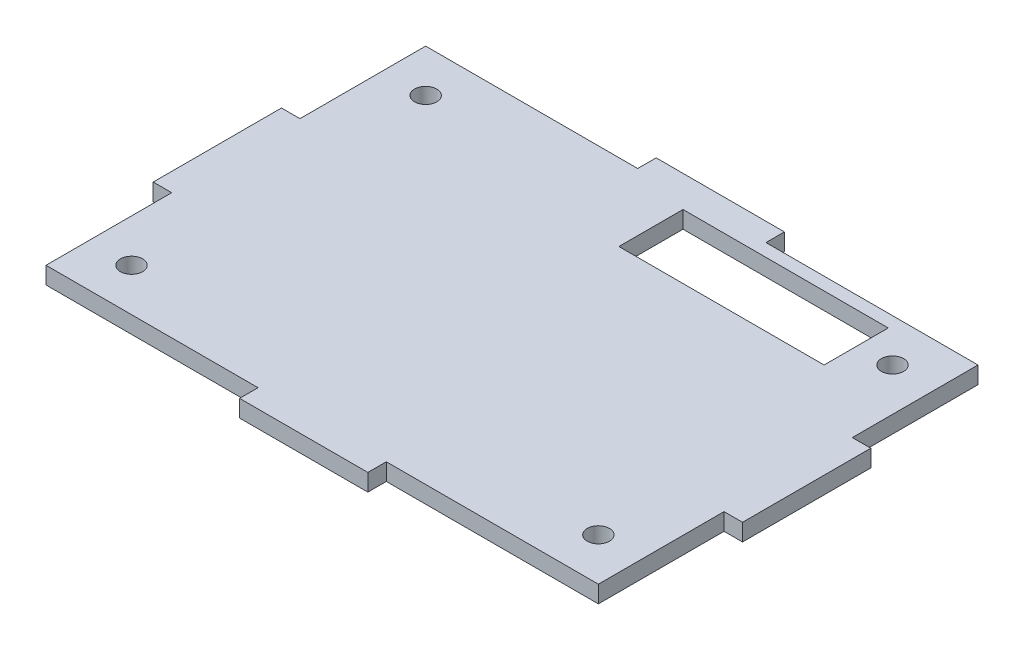
ISO-10303-21;
HEADER;
FILE_DESCRIPTION(('STEP AP214'),'2;1');
FILE_NAME('part.step','',(''),(''),'','','');
FILE_SCHEMA(('AUTOMOTIVE_DESIGN { 1 0 10303 214 1 1 1 1 }'));
ENDSEC;
DATA;
#1=APPLICATION_CONTEXT('core data for automotive mechanical design processes');
#2=APPLICATION_PROTOCOL_DEFINITION('international standard','automotive_design',2000,#1);
#3=PRODUCT_CONTEXT('',#1,'mechanical');
#4=PRODUCT('Part','Part','',(#3));
#5=PRODUCT_RELATED_PRODUCT_CATEGORY('part','',(#4));
#6=PRODUCT_DEFINITION_FORMATION('','',#4);
#7=PRODUCT_DEFINITION_CONTEXT('part definition',#1,'design');
#8=PRODUCT_DEFINITION('design','',#6,#7);
#9=PRODUCT_DEFINITION_SHAPE('','',#8);
#10=(LENGTH_UNIT() NAMED_UNIT(*) SI_UNIT(.MILLI.,.METRE.));
#11=(NAMED_UNIT(*) PLANE_ANGLE_UNIT() SI_UNIT($,.RADIAN.));
#12=(NAMED_UNIT(*) SI_UNIT($,.STERADIAN.) SOLID_ANGLE_UNIT());
#13=UNCERTAINTY_MEASURE_WITH_UNIT(LENGTH_MEASURE(1.E-05),#10,'distance_accuracy_value','');
#14=(GEOMETRIC_REPRESENTATION_CONTEXT(3) GLOBAL_UNCERTAINTY_ASSIGNED_CONTEXT((#13)) GLOBAL_UNIT_ASSIGNED_CONTEXT((#10,
#11,#12)) REPRESENTATION_CONTEXT('',''));
#15=CARTESIAN_POINT('',(0.,0.,0.));
#16=DIRECTION('',(0.,0.,1.));
#17=DIRECTION('',(1.,0.,0.));
#18=AXIS2_PLACEMENT_3D('',#15,#16,#17);
#19=CARTESIAN_POINT('',(-41.021,2.54,28.194));
#20=DIRECTION('',(1.,0.,0.));
#21=DIRECTION('',(0.,0.,-1.));
#22=AXIS2_PLACEMENT_3D('',#19,#20,#21);
#23=PLANE('',#22);
#24=DIRECTION('',(0.,1.,0.));
#25=VECTOR('',#24,1.);
#26=CARTESIAN_POINT('',(-41.021,-19.2464969862051,9.525));
#27=LINE('',#26,#25);
#28=CARTESIAN_POINT('',(-41.021,0.,9.52500000000001));
#29=VERTEX_POINT('',#28);
#30=CARTESIAN_POINT('',(-41.021,2.54,9.525));
#31=VERTEX_POINT('',#30);
#32=EDGE_CURVE('E234',#29,#31,#27,.T.);
#33=ORIENTED_EDGE('',*,*,#32,.F.);
#34=DIRECTION('',(0.,0.,1.));
#35=VECTOR('',#34,1.);
#36=CARTESIAN_POINT('',(-41.021,0.,28.194));
#37=LINE('',#36,#35);
#38=CARTESIAN_POINT('',(-41.021,0.,28.194));
#39=VERTEX_POINT('',#38);
#40=EDGE_CURVE('E352',#29,#39,#37,.T.);
#41=ORIENTED_EDGE('',*,*,#40,.T.);
#42=DIRECTION('',(0.,-1.,0.));
#43=VECTOR('',#42,1.);
#44=CARTESIAN_POINT('',(-41.021,2.54,28.194));
#45=LINE('',#44,#43);
#46=CARTESIAN_POINT('',(-41.021,2.54,28.194));
#47=VERTEX_POINT('',#46);
#48=EDGE_CURVE('E11',#47,#39,#45,.T.);
#49=ORIENTED_EDGE('',*,*,#48,.F.);
#50=DIRECTION('',(0.,0.,1.));
#51=VECTOR('',#50,1.);
#52=CARTESIAN_POINT('',(-41.021,2.54,28.194));
#53=LINE('',#52,#51);
#54=EDGE_CURVE('E359',#31,#47,#53,.T.);
#55=ORIENTED_EDGE('',*,*,#54,.F.);
#56=EDGE_LOOP('',(#33,#41,#49,#55));
#57=FACE_BOUND('',#56,.T.);
#58=ADVANCED_FACE('F33',(#57),#23,.F.);
#59=CARTESIAN_POINT('',(41.021,2.54,28.194));
#60=DIRECTION('',(-1.,0.,0.));
#61=DIRECTION('',(0.,0.,1.));
#62=AXIS2_PLACEMENT_3D('',#59,#60,#61);
#63=PLANE('',#62);
#64=DIRECTION('',(0.,1.,0.));
#65=VECTOR('',#64,1.);
#66=CARTESIAN_POINT('',(41.021,-19.2464969862051,-9.525));
#67=LINE('',#66,#65);
#68=CARTESIAN_POINT('',(41.021,0.,-9.52499999999998));
#69=VERTEX_POINT('',#68);
#70=CARTESIAN_POINT('',(41.021,2.54,-9.525));
#71=VERTEX_POINT('',#70);
#72=EDGE_CURVE('E259',#69,#71,#67,.T.);
#73=ORIENTED_EDGE('',*,*,#72,.F.);
#74=DIRECTION('',(0.,0.,-1.));
#75=VECTOR('',#74,1.);
#76=CARTESIAN_POINT('',(41.021,0.,28.194));
#77=LINE('',#76,#75);
#78=CARTESIAN_POINT('',(41.021,0.,-28.194));
#79=VERTEX_POINT('',#78);
#80=EDGE_CURVE('E377',#69,#79,#77,.T.);
#81=ORIENTED_EDGE('',*,*,#80,.T.);
#82=DIRECTION('',(0.,-1.,0.));
#83=VECTOR('',#82,1.);
#84=CARTESIAN_POINT('',(41.021,2.54,-28.194));
#85=LINE('',#84,#83);
#86=CARTESIAN_POINT('',(41.021,2.54,-28.194));
#87=VERTEX_POINT('',#86);
#88=EDGE_CURVE('E385',#87,#79,#85,.T.);
#89=ORIENTED_EDGE('',*,*,#88,.F.);
#90=DIRECTION('',(0.,0.,-1.));
#91=VECTOR('',#90,1.);
#92=CARTESIAN_POINT('',(41.021,2.54,28.194));
#93=LINE('',#92,#91);
#94=EDGE_CURVE('E363',#71,#87,#93,.T.);
#95=ORIENTED_EDGE('',*,*,#94,.F.);
#96=EDGE_LOOP('',(#73,#81,#89,#95));
#97=FACE_BOUND('',#96,.T.);
#98=ADVANCED_FACE('F473',(#97),#63,.F.);
#99=CARTESIAN_POINT('',(41.021,2.54,28.194));
#100=DIRECTION('',(0.,0.,-1.));
#101=DIRECTION('',(-1.,0.,0.));
#102=AXIS2_PLACEMENT_3D('',#99,#100,#101);
#103=PLANE('',#102);
#104=DIRECTION('',(0.,1.,0.));
#105=VECTOR('',#104,1.);
#106=CARTESIAN_POINT('',(9.52500000000001,-19.2464969862051,28.194));
#107=LINE('',#106,#105);
#108=CARTESIAN_POINT('',(9.52500000000001,0.,28.194));
#109=VERTEX_POINT('',#108);
#110=CARTESIAN_POINT('',(9.52500000000001,2.54,28.194));
#111=VERTEX_POINT('',#110);
#112=EDGE_CURVE('E298',#109,#111,#107,.T.);
#113=ORIENTED_EDGE('',*,*,#112,.F.);
#114=DIRECTION('',(1.,0.,0.));
#115=VECTOR('',#114,1.);
#116=CARTESIAN_POINT('',(41.021,0.,28.194));
#117=LINE('',#116,#115);
#118=CARTESIAN_POINT('',(41.021,0.,28.194));
#119=VERTEX_POINT('',#118);
#120=EDGE_CURVE('E374',#109,#119,#117,.T.);
#121=ORIENTED_EDGE('',*,*,#120,.T.);
#122=DIRECTION('',(0.,-1.,0.));
#123=VECTOR('',#122,1.);
#124=CARTESIAN_POINT('',(41.021,2.54,28.194));
#125=LINE('',#124,#123);
#126=CARTESIAN_POINT('',(41.021,2.54,28.194));
#127=VERTEX_POINT('',#126);
#128=EDGE_CURVE('E41',#127,#119,#125,.T.);
#129=ORIENTED_EDGE('',*,*,#128,.F.);
#130=DIRECTION('',(1.,0.,0.));
#131=VECTOR('',#130,1.);
#132=CARTESIAN_POINT('',(41.021,2.54,28.194));
#133=LINE('',#132,#131);
#134=EDGE_CURVE('E358',#111,#127,#133,.T.);
#135=ORIENTED_EDGE('',*,*,#134,.F.);
#136=EDGE_LOOP('',(#113,#121,#129,#135));
#137=FACE_BOUND('',#136,.T.);
#138=ADVANCED_FACE('F409',(#137),#103,.F.);
#139=CARTESIAN_POINT('',(41.021,2.54,-28.194));
#140=DIRECTION('',(0.,0.,1.));
#141=DIRECTION('',(1.,0.,0.));
#142=AXIS2_PLACEMENT_3D('',#139,#140,#141);
#143=PLANE('',#142);
#144=DIRECTION('',(0.,1.,0.));
#145=VECTOR('',#144,1.);
#146=CARTESIAN_POINT('',(-9.525,-19.2464969862051,-28.194));
#147=LINE('',#146,#145);
#148=CARTESIAN_POINT('',(-9.525,0.,-28.194));
#149=VERTEX_POINT('',#148);
#150=CARTESIAN_POINT('',(-9.525,2.54,-28.194));
#151=VERTEX_POINT('',#150);
#152=EDGE_CURVE('E323',#149,#151,#147,.T.);
#153=ORIENTED_EDGE('',*,*,#152,.F.);
#154=DIRECTION('',(-1.,0.,0.));
#155=VECTOR('',#154,1.);
#156=CARTESIAN_POINT('',(41.021,0.,-28.194));
#157=LINE('',#156,#155);
#158=CARTESIAN_POINT('',(-41.021,0.,-28.194));
#159=VERTEX_POINT('',#158);
#160=EDGE_CURVE('E380',#149,#159,#157,.T.);
#161=ORIENTED_EDGE('',*,*,#160,.T.);
#162=DIRECTION('',(0.,-1.,0.));
#163=VECTOR('',#162,1.);
#164=CARTESIAN_POINT('',(-41.021,2.54,-28.194));
#165=LINE('',#164,#163);
#166=CARTESIAN_POINT('',(-41.021,2.54,-28.194));
#167=VERTEX_POINT('',#166);
#168=EDGE_CURVE('E371',#167,#159,#165,.T.);
#169=ORIENTED_EDGE('',*,*,#168,.F.);
#170=DIRECTION('',(-1.,0.,0.));
#171=VECTOR('',#170,1.);
#172=CARTESIAN_POINT('',(41.021,2.54,-28.194));
#173=LINE('',#172,#171);
#174=EDGE_CURVE('E367',#151,#167,#173,.T.);
#175=ORIENTED_EDGE('',*,*,#174,.F.);
#176=EDGE_LOOP('',(#153,#161,#169,#175));
#177=FACE_BOUND('',#176,.T.);
#178=ADVANCED_FACE('F451',(#177),#143,.F.);
#179=CARTESIAN_POINT('',(0.,2.54,0.));
#180=DIRECTION('',(0.,1.,0.));
#181=DIRECTION('',(0.,0.,1.));
#182=AXIS2_PLACEMENT_3D('',#179,#180,#181);
#183=PLANE('',#182);
#184=DIRECTION('',(0.,0.,-1.));
#185=VECTOR('',#184,1.);
#186=CARTESIAN_POINT('',(29.591,2.54,-26.289));
#187=LINE('',#186,#185);
#188=CARTESIAN_POINT('',(29.591,2.54,-16.764));
#189=VERTEX_POINT('',#188);
#190=CARTESIAN_POINT('',(29.591,2.54,-26.289));
#191=VERTEX_POINT('',#190);
#192=EDGE_CURVE('E48',#189,#191,#187,.T.);
#193=ORIENTED_EDGE('',*,*,#192,.F.);
#194=DIRECTION('',(1.,0.,0.));
#195=VECTOR('',#194,1.);
#196=CARTESIAN_POINT('',(-0.888999999999982,2.54,-16.764));
#197=LINE('',#196,#195);
#198=CARTESIAN_POINT('',(-0.888999999999982,2.54,-16.764));
#199=VERTEX_POINT('',#198);
#200=EDGE_CURVE('E212',#199,#189,#197,.T.);
#201=ORIENTED_EDGE('',*,*,#200,.F.);
#202=DIRECTION('',(0.,0.,1.));
#203=VECTOR('',#202,1.);
#204=CARTESIAN_POINT('',(-0.888999999999984,2.54,-26.289));
#205=LINE('',#204,#203);
#206=CARTESIAN_POINT('',(-0.888999999999984,2.54,-26.289));
#207=VERTEX_POINT('',#206);
#208=EDGE_CURVE('E215',#207,#199,#205,.T.);
#209=ORIENTED_EDGE('',*,*,#208,.F.);
#210=DIRECTION('',(-1.,0.,0.));
#211=VECTOR('',#210,1.);
#212=CARTESIAN_POINT('',(-0.888999999999984,2.54,-26.289));
#213=LINE('',#212,#211);
#214=EDGE_CURVE('E221',#191,#207,#213,.T.);
#215=ORIENTED_EDGE('',*,*,#214,.F.);
#216=EDGE_LOOP('',(#193,#201,#209,#215));
#217=FACE_BOUND('',#216,.T.);
#218=CARTESIAN_POINT('',(34.671,2.54,21.844));
#219=DIRECTION('',(0.,1.,0.));
#220=DIRECTION('',(0.,0.,1.));
#221=AXIS2_PLACEMENT_3D('',#218,#219,#220);
#222=CIRCLE('',#221,1.651);
#223=CARTESIAN_POINT('',(34.671,2.54,23.495));
#224=VERTEX_POINT('',#223);
#225=EDGE_CURVE('E337',#224,#224,#222,.T.);
#226=ORIENTED_EDGE('',*,*,#225,.F.);
#227=EDGE_LOOP('',(#226));
#228=FACE_BOUND('',#227,.T.);
#229=CARTESIAN_POINT('',(-34.671,2.54,-21.844));
#230=DIRECTION('',(0.,1.,0.));
#231=DIRECTION('',(0.,0.,1.));
#232=AXIS2_PLACEMENT_3D('',#229,#230,#231);
#233=CIRCLE('',#232,1.651);
#234=CARTESIAN_POINT('',(-34.671,2.54,-20.193));
#235=VERTEX_POINT('',#234);
#236=EDGE_CURVE('E349',#235,#235,#233,.T.);
#237=ORIENTED_EDGE('',*,*,#236,.F.);
#238=EDGE_LOOP('',(#237));
#239=FACE_BOUND('',#238,.T.);
#240=CARTESIAN_POINT('',(-41.021,2.54,-9.52499999999999));
#241=VERTEX_POINT('',#240);
#242=EDGE_CURVE('E355',#167,#241,#53,.T.);
#243=ORIENTED_EDGE('',*,*,#242,.T.);
#244=DIRECTION('',(-1.,0.,0.));
#245=VECTOR('',#244,1.);
#246=CARTESIAN_POINT('',(-41.021,2.54,-9.525));
#247=LINE('',#246,#245);
#248=CARTESIAN_POINT('',(-43.7642,2.54,-9.525));
#249=VERTEX_POINT('',#248);
#250=EDGE_CURVE('E227',#241,#249,#247,.T.);
#251=ORIENTED_EDGE('',*,*,#250,.T.);
#252=DIRECTION('',(0.,0.,1.));
#253=VECTOR('',#252,1.);
#254=CARTESIAN_POINT('',(-43.7642,2.54,-9.525));
#255=LINE('',#254,#253);
#256=CARTESIAN_POINT('',(-43.7642,2.54,9.525));
#257=VERTEX_POINT('',#256);
#258=EDGE_CURVE('E239',#249,#257,#255,.T.);
#259=ORIENTED_EDGE('',*,*,#258,.T.);
#260=DIRECTION('',(1.,0.,0.));
#261=VECTOR('',#260,1.);
#262=CARTESIAN_POINT('',(-41.021,2.54,9.525));
#263=LINE('',#262,#261);
#264=EDGE_CURVE('E242',#257,#31,#263,.T.);
#265=ORIENTED_EDGE('',*,*,#264,.T.);
#266=ORIENTED_EDGE('',*,*,#54,.T.);
#267=CARTESIAN_POINT('',(-9.525,2.54,28.194));
#268=VERTEX_POINT('',#267);
#269=EDGE_CURVE('E360',#47,#268,#133,.T.);
#270=ORIENTED_EDGE('',*,*,#269,.T.);
#271=DIRECTION('',(0.,0.,1.));
#272=VECTOR('',#271,1.);
#273=CARTESIAN_POINT('',(-9.525,2.54,28.194));
#274=LINE('',#273,#272);
#275=CARTESIAN_POINT('',(-9.525,2.54,30.9372));
#276=VERTEX_POINT('',#275);
#277=EDGE_CURVE('E280',#268,#276,#274,.T.);
#278=ORIENTED_EDGE('',*,*,#277,.T.);
#279=DIRECTION('',(1.,0.,0.));
#280=VECTOR('',#279,1.);
#281=CARTESIAN_POINT('',(-9.525,2.54,30.9372));
#282=LINE('',#281,#280);
#283=CARTESIAN_POINT('',(9.525,2.54,30.9372));
#284=VERTEX_POINT('',#283);
#285=EDGE_CURVE('E290',#276,#284,#282,.T.);
#286=ORIENTED_EDGE('',*,*,#285,.T.);
#287=DIRECTION('',(0.,0.,-1.));
#288=VECTOR('',#287,1.);
#289=CARTESIAN_POINT('',(9.52500000000001,2.54,28.194));
#290=LINE('',#289,#288);
#291=EDGE_CURVE('E293',#284,#111,#290,.T.);
#292=ORIENTED_EDGE('',*,*,#291,.T.);
#293=ORIENTED_EDGE('',*,*,#134,.T.);
#294=CARTESIAN_POINT('',(41.021,2.54,9.52500000000001));
#295=VERTEX_POINT('',#294);
#296=EDGE_CURVE('E364',#127,#295,#93,.T.);
#297=ORIENTED_EDGE('',*,*,#296,.T.);
#298=DIRECTION('',(1.,0.,0.));
#299=VECTOR('',#298,1.);
#300=CARTESIAN_POINT('',(41.021,2.54,9.525));
#301=LINE('',#300,#299);
#302=CARTESIAN_POINT('',(43.7642,2.54,9.525));
#303=VERTEX_POINT('',#302);
#304=EDGE_CURVE('E255',#295,#303,#301,.T.);
#305=ORIENTED_EDGE('',*,*,#304,.T.);
#306=DIRECTION('',(0.,0.,-1.));
#307=VECTOR('',#306,1.);
#308=CARTESIAN_POINT('',(43.7642,2.54,-9.525));
#309=LINE('',#308,#307);
#310=CARTESIAN_POINT('',(43.7642,2.54,-9.525));
#311=VERTEX_POINT('',#310);
#312=EDGE_CURVE('E264',#303,#311,#309,.T.);
#313=ORIENTED_EDGE('',*,*,#312,.T.);
#314=DIRECTION('',(-1.,0.,0.));
#315=VECTOR('',#314,1.);
#316=CARTESIAN_POINT('',(41.021,2.54,-9.525));
#317=LINE('',#316,#315);
#318=EDGE_CURVE('E267',#311,#71,#317,.T.);
#319=ORIENTED_EDGE('',*,*,#318,.T.);
#320=ORIENTED_EDGE('',*,*,#94,.T.);
#321=CARTESIAN_POINT('',(9.525,2.54,-28.194));
#322=VERTEX_POINT('',#321);
#323=EDGE_CURVE('E368',#87,#322,#173,.T.);
#324=ORIENTED_EDGE('',*,*,#323,.T.);
#325=DIRECTION('',(0.,0.,-1.));
#326=VECTOR('',#325,1.);
#327=CARTESIAN_POINT('',(9.525,2.54,-28.194));
#328=LINE('',#327,#326);
#329=CARTESIAN_POINT('',(9.525,2.54,-30.9372));
#330=VERTEX_POINT('',#329);
#331=EDGE_CURVE('E305',#322,#330,#328,.T.);
#332=ORIENTED_EDGE('',*,*,#331,.T.);
#333=DIRECTION('',(-1.,0.,0.));
#334=VECTOR('',#333,1.);
#335=CARTESIAN_POINT('',(9.525,2.54,-30.9372));
#336=LINE('',#335,#334);
#337=CARTESIAN_POINT('',(-9.525,2.54,-30.9372));
#338=VERTEX_POINT('',#337);
#339=EDGE_CURVE('E315',#330,#338,#336,.T.);
#340=ORIENTED_EDGE('',*,*,#339,.T.);
#341=DIRECTION('',(0.,0.,1.));
#342=VECTOR('',#341,1.);
#343=CARTESIAN_POINT('',(-9.525,2.54,-28.194));
#344=LINE('',#343,#342);
#345=EDGE_CURVE('E318',#338,#151,#344,.T.);
#346=ORIENTED_EDGE('',*,*,#345,.T.);
#347=ORIENTED_EDGE('',*,*,#174,.T.);
#348=EDGE_LOOP('',(#243,#251,#259,#265,#266,#270,#278,#286,#292,#293,#297,#305,#313,#319,#320,
#324,#332,#340,#346,#347));
#349=FACE_BOUND('',#348,.T.);
#350=CARTESIAN_POINT('',(-34.671,2.54,21.844));
#351=DIRECTION('',(0.,1.,0.));
#352=DIRECTION('',(0.,0.,1.));
#353=AXIS2_PLACEMENT_3D('',#350,#351,#352);
#354=CIRCLE('',#353,1.651);
#355=CARTESIAN_POINT('',(-34.671,2.54,23.495));
#356=VERTEX_POINT('',#355);
#357=EDGE_CURVE('E343',#356,#356,#354,.T.);
#358=ORIENTED_EDGE('',*,*,#357,.F.);
#359=EDGE_LOOP('',(#358));
#360=FACE_BOUND('',#359,.T.);
#361=CARTESIAN_POINT('',(34.671,2.54,-21.844));
#362=DIRECTION('',(0.,1.,0.));
#363=DIRECTION('',(0.,0.,1.));
#364=AXIS2_PLACEMENT_3D('',#361,#362,#363);
#365=CIRCLE('',#364,1.651);
#366=CARTESIAN_POINT('',(34.671,2.54,-20.193));
#367=VERTEX_POINT('',#366);
#368=EDGE_CURVE('E331',#367,#367,#365,.T.);
#369=ORIENTED_EDGE('',*,*,#368,.F.);
#370=EDGE_LOOP('',(#369));
#371=FACE_BOUND('',#370,.T.);
#372=ADVANCED_FACE('F406',(#217,#228,#239,#349,#360,#371),#183,.T.);
#373=CARTESIAN_POINT('',(0.,0.,0.));
#374=DIRECTION('',(0.,1.,0.));
#375=DIRECTION('',(0.,0.,1.));
#376=AXIS2_PLACEMENT_3D('',#373,#374,#375);
#377=PLANE('',#376);
#378=DIRECTION('',(1.,0.,0.));
#379=VECTOR('',#378,1.);
#380=CARTESIAN_POINT('',(-0.888999999999982,0.,-16.764));
#381=LINE('',#380,#379);
#382=CARTESIAN_POINT('',(-0.888999999999982,0.,-16.764));
#383=VERTEX_POINT('',#382);
#384=CARTESIAN_POINT('',(29.591,0.,-16.764));
#385=VERTEX_POINT('',#384);
#386=EDGE_CURVE('E202',#383,#385,#381,.T.);
#387=ORIENTED_EDGE('',*,*,#386,.T.);
#388=DIRECTION('',(0.,0.,-1.));
#389=VECTOR('',#388,1.);
#390=CARTESIAN_POINT('',(29.591,0.,-26.289));
#391=LINE('',#390,#389);
#392=CARTESIAN_POINT('',(29.591,0.,-26.289));
#393=VERTEX_POINT('',#392);
#394=EDGE_CURVE('E196',#385,#393,#391,.T.);
#395=ORIENTED_EDGE('',*,*,#394,.T.);
#396=DIRECTION('',(-1.,0.,0.));
#397=VECTOR('',#396,1.);
#398=CARTESIAN_POINT('',(-0.888999999999984,0.,-26.289));
#399=LINE('',#398,#397);
#400=CARTESIAN_POINT('',(-0.888999999999984,0.,-26.289));
#401=VERTEX_POINT('',#400);
#402=EDGE_CURVE('E205',#393,#401,#399,.T.);
#403=ORIENTED_EDGE('',*,*,#402,.T.);
#404=DIRECTION('',(0.,0.,1.));
#405=VECTOR('',#404,1.);
#406=CARTESIAN_POINT('',(-0.888999999999984,0.,-26.289));
#407=LINE('',#406,#405);
#408=EDGE_CURVE('E56',#401,#383,#407,.T.);
#409=ORIENTED_EDGE('',*,*,#408,.T.);
#410=EDGE_LOOP('',(#387,#395,#403,#409));
#411=FACE_BOUND('',#410,.T.);
#412=CARTESIAN_POINT('',(-41.021,0.,-9.52499999999999));
#413=VERTEX_POINT('',#412);
#414=EDGE_CURVE('E372',#159,#413,#37,.T.);
#415=ORIENTED_EDGE('',*,*,#414,.F.);
#416=ORIENTED_EDGE('',*,*,#160,.F.);
#417=DIRECTION('',(0.,0.,-1.));
#418=VECTOR('',#417,1.);
#419=CARTESIAN_POINT('',(-9.525,0.,-28.194));
#420=LINE('',#419,#418);
#421=CARTESIAN_POINT('',(-9.525,0.,-30.9372));
#422=VERTEX_POINT('',#421);
#423=EDGE_CURVE('E306',#149,#422,#420,.T.);
#424=ORIENTED_EDGE('',*,*,#423,.T.);
#425=DIRECTION('',(1.,0.,0.));
#426=VECTOR('',#425,1.);
#427=CARTESIAN_POINT('',(9.525,0.,-30.9372));
#428=LINE('',#427,#426);
#429=CARTESIAN_POINT('',(9.525,0.,-30.9372));
#430=VERTEX_POINT('',#429);
#431=EDGE_CURVE('E312',#422,#430,#428,.T.);
#432=ORIENTED_EDGE('',*,*,#431,.T.);
#433=DIRECTION('',(0.,0.,1.));
#434=VECTOR('',#433,1.);
#435=CARTESIAN_POINT('',(9.525,0.,-28.194));
#436=LINE('',#435,#434);
#437=CARTESIAN_POINT('',(9.525,0.,-28.194));
#438=VERTEX_POINT('',#437);
#439=EDGE_CURVE('E308',#430,#438,#436,.T.);
#440=ORIENTED_EDGE('',*,*,#439,.T.);
#441=EDGE_CURVE('E381',#79,#438,#157,.T.);
#442=ORIENTED_EDGE('',*,*,#441,.F.);
#443=ORIENTED_EDGE('',*,*,#80,.F.);
#444=DIRECTION('',(1.,0.,0.));
#445=VECTOR('',#444,1.);
#446=CARTESIAN_POINT('',(41.021,0.,-9.525));
#447=LINE('',#446,#445);
#448=CARTESIAN_POINT('',(43.7642,0.,-9.525));
#449=VERTEX_POINT('',#448);
#450=EDGE_CURVE('E258',#69,#449,#447,.T.);
#451=ORIENTED_EDGE('',*,*,#450,.T.);
#452=DIRECTION('',(0.,0.,1.));
#453=VECTOR('',#452,1.);
#454=CARTESIAN_POINT('',(43.7642,0.,-9.525));
#455=LINE('',#454,#453);
#456=CARTESIAN_POINT('',(43.7642,0.,9.525));
#457=VERTEX_POINT('',#456);
#458=EDGE_CURVE('E256',#449,#457,#455,.T.);
#459=ORIENTED_EDGE('',*,*,#458,.T.);
#460=DIRECTION('',(-1.,0.,0.));
#461=VECTOR('',#460,1.);
#462=CARTESIAN_POINT('',(41.021,0.,9.525));
#463=LINE('',#462,#461);
#464=CARTESIAN_POINT('',(41.021,0.,9.52500000000001));
#465=VERTEX_POINT('',#464);
#466=EDGE_CURVE('E261',#457,#465,#463,.T.);
#467=ORIENTED_EDGE('',*,*,#466,.T.);
#468=EDGE_CURVE('E378',#119,#465,#77,.T.);
#469=ORIENTED_EDGE('',*,*,#468,.F.);
#470=ORIENTED_EDGE('',*,*,#120,.F.);
#471=DIRECTION('',(0.,0.,1.));
#472=VECTOR('',#471,1.);
#473=CARTESIAN_POINT('',(9.52500000000001,0.,28.194));
#474=LINE('',#473,#472);
#475=CARTESIAN_POINT('',(9.525,0.,30.9372));
#476=VERTEX_POINT('',#475);
#477=EDGE_CURVE('E281',#109,#476,#474,.T.);
#478=ORIENTED_EDGE('',*,*,#477,.T.);
#479=DIRECTION('',(-1.,0.,0.));
#480=VECTOR('',#479,1.);
#481=CARTESIAN_POINT('',(-9.525,0.,30.9372));
#482=LINE('',#481,#480);
#483=CARTESIAN_POINT('',(-9.525,0.,30.9372));
#484=VERTEX_POINT('',#483);
#485=EDGE_CURVE('E287',#476,#484,#482,.T.);
#486=ORIENTED_EDGE('',*,*,#485,.T.);
#487=DIRECTION('',(0.,0.,-1.));
#488=VECTOR('',#487,1.);
#489=CARTESIAN_POINT('',(-9.525,0.,28.194));
#490=LINE('',#489,#488);
#491=CARTESIAN_POINT('',(-9.525,0.,28.194));
#492=VERTEX_POINT('',#491);
#493=EDGE_CURVE('E283',#484,#492,#490,.T.);
#494=ORIENTED_EDGE('',*,*,#493,.T.);
#495=EDGE_CURVE('E375',#39,#492,#117,.T.);
#496=ORIENTED_EDGE('',*,*,#495,.F.);
#497=ORIENTED_EDGE('',*,*,#40,.F.);
#498=DIRECTION('',(-1.,0.,0.));
#499=VECTOR('',#498,1.);
#500=CARTESIAN_POINT('',(-41.021,0.,9.525));
#501=LINE('',#500,#499);
#502=CARTESIAN_POINT('',(-43.7642,0.,9.525));
#503=VERTEX_POINT('',#502);
#504=EDGE_CURVE('E233',#29,#503,#501,.T.);
#505=ORIENTED_EDGE('',*,*,#504,.T.);
#506=DIRECTION('',(0.,0.,-1.));
#507=VECTOR('',#506,1.);
#508=CARTESIAN_POINT('',(-43.7642,0.,-9.525));
#509=LINE('',#508,#507);
#510=CARTESIAN_POINT('',(-43.7642,0.,-9.525));
#511=VERTEX_POINT('',#510);
#512=EDGE_CURVE('E231',#503,#511,#509,.T.);
#513=ORIENTED_EDGE('',*,*,#512,.T.);
#514=DIRECTION('',(1.,0.,0.));
#515=VECTOR('',#514,1.);
#516=CARTESIAN_POINT('',(-41.021,0.,-9.525));
#517=LINE('',#516,#515);
#518=EDGE_CURVE('E236',#511,#413,#517,.T.);
#519=ORIENTED_EDGE('',*,*,#518,.T.);
#520=EDGE_LOOP('',(#415,#416,#424,#432,#440,#442,#443,#451,#459,#467,#469,#470,#478,#486,#494,
#496,#497,#505,#513,#519));
#521=FACE_BOUND('',#520,.T.);
#522=CARTESIAN_POINT('',(-34.671,0.,-21.844));
#523=DIRECTION('',(0.,1.,0.));
#524=DIRECTION('',(0.,0.,1.));
#525=AXIS2_PLACEMENT_3D('',#522,#523,#524);
#526=CIRCLE('',#525,1.651);
#527=CARTESIAN_POINT('',(-34.671,0.,-20.193));
#528=VERTEX_POINT('',#527);
#529=EDGE_CURVE('E346',#528,#528,#526,.T.);
#530=ORIENTED_EDGE('',*,*,#529,.T.);
#531=EDGE_LOOP('',(#530));
#532=FACE_BOUND('',#531,.T.);
#533=CARTESIAN_POINT('',(-34.671,0.,21.844));
#534=DIRECTION('',(0.,1.,0.));
#535=DIRECTION('',(0.,0.,1.));
#536=AXIS2_PLACEMENT_3D('',#533,#534,#535);
#537=CIRCLE('',#536,1.651);
#538=CARTESIAN_POINT('',(-34.671,0.,23.495));
#539=VERTEX_POINT('',#538);
#540=EDGE_CURVE('E340',#539,#539,#537,.T.);
#541=ORIENTED_EDGE('',*,*,#540,.T.);
#542=EDGE_LOOP('',(#541));
#543=FACE_BOUND('',#542,.T.);
#544=CARTESIAN_POINT('',(34.671,0.,21.844));
#545=DIRECTION('',(0.,1.,0.));
#546=DIRECTION('',(0.,0.,1.));
#547=AXIS2_PLACEMENT_3D('',#544,#545,#546);
#548=CIRCLE('',#547,1.651);
#549=CARTESIAN_POINT('',(34.671,0.,23.495));
#550=VERTEX_POINT('',#549);
#551=EDGE_CURVE('E334',#550,#550,#548,.T.);
#552=ORIENTED_EDGE('',*,*,#551,.T.);
#553=EDGE_LOOP('',(#552));
#554=FACE_BOUND('',#553,.T.);
#555=CARTESIAN_POINT('',(34.671,0.,-21.844));
#556=DIRECTION('',(0.,1.,0.));
#557=DIRECTION('',(0.,0.,1.));
#558=AXIS2_PLACEMENT_3D('',#555,#556,#557);
#559=CIRCLE('',#558,1.651);
#560=CARTESIAN_POINT('',(34.671,0.,-20.193));
#561=VERTEX_POINT('',#560);
#562=EDGE_CURVE('E330',#561,#561,#559,.T.);
#563=ORIENTED_EDGE('',*,*,#562,.T.);
#564=EDGE_LOOP('',(#563));
#565=FACE_BOUND('',#564,.T.);
#566=ADVANCED_FACE('F209',(#411,#521,#532,#543,#554,#565),#377,.F.);
#567=ORIENTED_EDGE('',*,*,#414,.T.);
#568=DIRECTION('',(0.,1.,0.));
#569=VECTOR('',#568,1.);
#570=CARTESIAN_POINT('',(-41.021,-19.2464969862051,-9.525));
#571=LINE('',#570,#569);
#572=EDGE_CURVE('E245',#413,#241,#571,.T.);
#573=ORIENTED_EDGE('',*,*,#572,.T.);
#574=ORIENTED_EDGE('',*,*,#242,.F.);
#575=ORIENTED_EDGE('',*,*,#168,.T.);
#576=EDGE_LOOP('',(#567,#573,#574,#575));
#577=FACE_BOUND('',#576,.T.);
#578=ADVANCED_FACE('F35',(#577),#23,.F.);
#579=ORIENTED_EDGE('',*,*,#495,.T.);
#580=DIRECTION('',(0.,1.,0.));
#581=VECTOR('',#580,1.);
#582=CARTESIAN_POINT('',(-9.525,-19.2464969862051,28.194));
#583=LINE('',#582,#581);
#584=EDGE_CURVE('E284',#492,#268,#583,.T.);
#585=ORIENTED_EDGE('',*,*,#584,.T.);
#586=ORIENTED_EDGE('',*,*,#269,.F.);
#587=ORIENTED_EDGE('',*,*,#48,.T.);
#588=EDGE_LOOP('',(#579,#585,#586,#587));
#589=FACE_BOUND('',#588,.T.);
#590=ADVANCED_FACE('F427',(#589),#103,.F.);
#591=ORIENTED_EDGE('',*,*,#468,.T.);
#592=DIRECTION('',(0.,1.,0.));
#593=VECTOR('',#592,1.);
#594=CARTESIAN_POINT('',(41.021,-19.2464969862051,9.525));
#595=LINE('',#594,#593);
#596=EDGE_CURVE('E270',#465,#295,#595,.T.);
#597=ORIENTED_EDGE('',*,*,#596,.T.);
#598=ORIENTED_EDGE('',*,*,#296,.F.);
#599=ORIENTED_EDGE('',*,*,#128,.T.);
#600=EDGE_LOOP('',(#591,#597,#598,#599));
#601=FACE_BOUND('',#600,.T.);
#602=ADVANCED_FACE('F392',(#601),#63,.F.);
#603=ORIENTED_EDGE('',*,*,#441,.T.);
#604=DIRECTION('',(0.,1.,0.));
#605=VECTOR('',#604,1.);
#606=CARTESIAN_POINT('',(9.525,-19.2464969862051,-28.194));
#607=LINE('',#606,#605);
#608=EDGE_CURVE('E309',#438,#322,#607,.T.);
#609=ORIENTED_EDGE('',*,*,#608,.T.);
#610=ORIENTED_EDGE('',*,*,#323,.F.);
#611=ORIENTED_EDGE('',*,*,#88,.T.);
#612=EDGE_LOOP('',(#603,#609,#610,#611));
#613=FACE_BOUND('',#612,.T.);
#614=ADVANCED_FACE('F469',(#613),#143,.F.);
#615=CARTESIAN_POINT('',(-34.671,2.54,-21.844));
#616=DIRECTION('',(0.,-1.,0.));
#617=DIRECTION('',(0.,0.,-1.));
#618=AXIS2_PLACEMENT_3D('',#615,#616,#617);
#619=CYLINDRICAL_SURFACE('',#618,1.651);
#620=ORIENTED_EDGE('',*,*,#236,.T.);
#621=EDGE_LOOP('',(#620));
#622=FACE_BOUND('',#621,.T.);
#623=ORIENTED_EDGE('',*,*,#529,.F.);
#624=EDGE_LOOP('',(#623));
#625=FACE_BOUND('',#624,.T.);
#626=ADVANCED_FACE('F509',(#622,#625),#619,.F.);
#627=CARTESIAN_POINT('',(-34.671,2.54,21.844));
#628=DIRECTION('',(0.,-1.,0.));
#629=DIRECTION('',(0.,0.,-1.));
#630=AXIS2_PLACEMENT_3D('',#627,#628,#629);
#631=CYLINDRICAL_SURFACE('',#630,1.651);
#632=ORIENTED_EDGE('',*,*,#357,.T.);
#633=EDGE_LOOP('',(#632));
#634=FACE_BOUND('',#633,.T.);
#635=ORIENTED_EDGE('',*,*,#540,.F.);
#636=EDGE_LOOP('',(#635));
#637=FACE_BOUND('',#636,.T.);
#638=ADVANCED_FACE('F526',(#634,#637),#631,.F.);
#639=CARTESIAN_POINT('',(34.671,2.54,21.844));
#640=DIRECTION('',(0.,-1.,0.));
#641=DIRECTION('',(0.,0.,-1.));
#642=AXIS2_PLACEMENT_3D('',#639,#640,#641);
#643=CYLINDRICAL_SURFACE('',#642,1.651);
#644=ORIENTED_EDGE('',*,*,#225,.T.);
#645=EDGE_LOOP('',(#644));
#646=FACE_BOUND('',#645,.T.);
#647=ORIENTED_EDGE('',*,*,#551,.F.);
#648=EDGE_LOOP('',(#647));
#649=FACE_BOUND('',#648,.T.);
#650=ADVANCED_FACE('F533',(#646,#649),#643,.F.);
#651=CARTESIAN_POINT('',(34.671,2.54,-21.844));
#652=DIRECTION('',(0.,-1.,0.));
#653=DIRECTION('',(0.,0.,-1.));
#654=AXIS2_PLACEMENT_3D('',#651,#652,#653);
#655=CYLINDRICAL_SURFACE('',#654,1.651);
#656=ORIENTED_EDGE('',*,*,#368,.T.);
#657=EDGE_LOOP('',(#656));
#658=FACE_BOUND('',#657,.T.);
#659=ORIENTED_EDGE('',*,*,#562,.F.);
#660=EDGE_LOOP('',(#659));
#661=FACE_BOUND('',#660,.T.);
#662=ADVANCED_FACE('F541',(#658,#661),#655,.F.);
#663=CARTESIAN_POINT('',(9.525,-19.2464969862051,-28.194));
#664=DIRECTION('',(1.,0.,0.));
#665=DIRECTION('',(0.,0.,-1.));
#666=AXIS2_PLACEMENT_3D('',#663,#664,#665);
#667=PLANE('',#666);
#668=ORIENTED_EDGE('',*,*,#439,.F.);
#669=DIRECTION('',(0.,1.,0.));
#670=VECTOR('',#669,1.);
#671=CARTESIAN_POINT('',(9.525,-19.2464969862051,-30.9372));
#672=LINE('',#671,#670);
#673=EDGE_CURVE('E321',#430,#330,#672,.T.);
#674=ORIENTED_EDGE('',*,*,#673,.T.);
#675=ORIENTED_EDGE('',*,*,#331,.F.);
#676=ORIENTED_EDGE('',*,*,#608,.F.);
#677=EDGE_LOOP('',(#668,#674,#675,#676));
#678=FACE_BOUND('',#677,.T.);
#679=ADVANCED_FACE('F466',(#678),#667,.T.);
#680=CARTESIAN_POINT('',(-9.525,-19.2464969862051,-28.194));
#681=DIRECTION('',(-1.,0.,0.));
#682=DIRECTION('',(0.,0.,1.));
#683=AXIS2_PLACEMENT_3D('',#680,#681,#682);
#684=PLANE('',#683);
#685=ORIENTED_EDGE('',*,*,#423,.F.);
#686=ORIENTED_EDGE('',*,*,#152,.T.);
#687=ORIENTED_EDGE('',*,*,#345,.F.);
#688=DIRECTION('',(0.,1.,0.));
#689=VECTOR('',#688,1.);
#690=CARTESIAN_POINT('',(-9.525,-19.2464969862051,-30.9372));
#691=LINE('',#690,#689);
#692=EDGE_CURVE('E326',#422,#338,#691,.T.);
#693=ORIENTED_EDGE('',*,*,#692,.F.);
#694=EDGE_LOOP('',(#685,#686,#687,#693));
#695=FACE_BOUND('',#694,.T.);
#696=ADVANCED_FACE('F454',(#695),#684,.T.);
#697=CARTESIAN_POINT('',(9.525,-19.2464969862051,-30.9372));
#698=DIRECTION('',(0.,0.,-1.));
#699=DIRECTION('',(-1.,0.,0.));
#700=AXIS2_PLACEMENT_3D('',#697,#698,#699);
#701=PLANE('',#700);
#702=ORIENTED_EDGE('',*,*,#431,.F.);
#703=ORIENTED_EDGE('',*,*,#692,.T.);
#704=ORIENTED_EDGE('',*,*,#339,.F.);
#705=ORIENTED_EDGE('',*,*,#673,.F.);
#706=EDGE_LOOP('',(#702,#703,#704,#705));
#707=FACE_BOUND('',#706,.T.);
#708=ADVANCED_FACE('F461',(#707),#701,.T.);
#709=CARTESIAN_POINT('',(-9.525,-19.2464969862051,28.194));
#710=DIRECTION('',(-1.,0.,0.));
#711=DIRECTION('',(0.,0.,1.));
#712=AXIS2_PLACEMENT_3D('',#709,#710,#711);
#713=PLANE('',#712);
#714=ORIENTED_EDGE('',*,*,#493,.F.);
#715=DIRECTION('',(0.,1.,0.));
#716=VECTOR('',#715,1.);
#717=CARTESIAN_POINT('',(-9.525,-19.2464969862051,30.9372));
#718=LINE('',#717,#716);
#719=EDGE_CURVE('E296',#484,#276,#718,.T.);
#720=ORIENTED_EDGE('',*,*,#719,.T.);
#721=ORIENTED_EDGE('',*,*,#277,.F.);
#722=ORIENTED_EDGE('',*,*,#584,.F.);
#723=EDGE_LOOP('',(#714,#720,#721,#722));
#724=FACE_BOUND('',#723,.T.);
#725=ADVANCED_FACE('F420',(#724),#713,.T.);
#726=CARTESIAN_POINT('',(9.52500000000001,-19.2464969862051,28.194));
#727=DIRECTION('',(1.,0.,0.));
#728=DIRECTION('',(0.,0.,-1.));
#729=AXIS2_PLACEMENT_3D('',#726,#727,#728);
#730=PLANE('',#729);
#731=ORIENTED_EDGE('',*,*,#477,.F.);
#732=ORIENTED_EDGE('',*,*,#112,.T.);
#733=ORIENTED_EDGE('',*,*,#291,.F.);
#734=DIRECTION('',(0.,1.,0.));
#735=VECTOR('',#734,1.);
#736=CARTESIAN_POINT('',(9.525,-19.2464969862051,30.9372));
#737=LINE('',#736,#735);
#738=EDGE_CURVE('E301',#476,#284,#737,.T.);
#739=ORIENTED_EDGE('',*,*,#738,.F.);
#740=EDGE_LOOP('',(#731,#732,#733,#739));
#741=FACE_BOUND('',#740,.T.);
#742=ADVANCED_FACE('F411',(#741),#730,.T.);
#743=CARTESIAN_POINT('',(-9.525,-19.2464969862051,30.9372));
#744=DIRECTION('',(0.,0.,1.));
#745=DIRECTION('',(1.,0.,0.));
#746=AXIS2_PLACEMENT_3D('',#743,#744,#745);
#747=PLANE('',#746);
#748=ORIENTED_EDGE('',*,*,#485,.F.);
#749=ORIENTED_EDGE('',*,*,#738,.T.);
#750=ORIENTED_EDGE('',*,*,#285,.F.);
#751=ORIENTED_EDGE('',*,*,#719,.F.);
#752=EDGE_LOOP('',(#748,#749,#750,#751));
#753=FACE_BOUND('',#752,.T.);
#754=ADVANCED_FACE('F423',(#753),#747,.T.);
#755=CARTESIAN_POINT('',(41.021,-19.2464969862051,-9.525));
#756=DIRECTION('',(0.,0.,-1.));
#757=DIRECTION('',(-1.,0.,0.));
#758=AXIS2_PLACEMENT_3D('',#755,#756,#757);
#759=PLANE('',#758);
#760=ORIENTED_EDGE('',*,*,#450,.F.);
#761=ORIENTED_EDGE('',*,*,#72,.T.);
#762=ORIENTED_EDGE('',*,*,#318,.F.);
#763=DIRECTION('',(0.,1.,0.));
#764=VECTOR('',#763,1.);
#765=CARTESIAN_POINT('',(43.7642,-19.2464969862051,-9.525));
#766=LINE('',#765,#764);
#767=EDGE_CURVE('E273',#449,#311,#766,.T.);
#768=ORIENTED_EDGE('',*,*,#767,.F.);
#769=EDGE_LOOP('',(#760,#761,#762,#768));
#770=FACE_BOUND('',#769,.T.);
#771=ADVANCED_FACE('F478',(#770),#759,.T.);
#772=CARTESIAN_POINT('',(43.7642,-19.2464969862051,-9.525));
#773=DIRECTION('',(1.,0.,0.));
#774=DIRECTION('',(0.,0.,-1.));
#775=AXIS2_PLACEMENT_3D('',#772,#773,#774);
#776=PLANE('',#775);
#777=ORIENTED_EDGE('',*,*,#458,.F.);
#778=ORIENTED_EDGE('',*,*,#767,.T.);
#779=ORIENTED_EDGE('',*,*,#312,.F.);
#780=DIRECTION('',(0.,1.,0.));
#781=VECTOR('',#780,1.);
#782=CARTESIAN_POINT('',(43.7642,-19.2464969862051,9.525));
#783=LINE('',#782,#781);
#784=EDGE_CURVE('E275',#457,#303,#783,.T.);
#785=ORIENTED_EDGE('',*,*,#784,.F.);
#786=EDGE_LOOP('',(#777,#778,#779,#785));
#787=FACE_BOUND('',#786,.T.);
#788=ADVANCED_FACE('F481',(#787),#776,.T.);
#789=CARTESIAN_POINT('',(41.021,-19.2464969862051,9.525));
#790=DIRECTION('',(0.,0.,1.));
#791=DIRECTION('',(1.,0.,0.));
#792=AXIS2_PLACEMENT_3D('',#789,#790,#791);
#793=PLANE('',#792);
#794=ORIENTED_EDGE('',*,*,#466,.F.);
#795=ORIENTED_EDGE('',*,*,#784,.T.);
#796=ORIENTED_EDGE('',*,*,#304,.F.);
#797=ORIENTED_EDGE('',*,*,#596,.F.);
#798=EDGE_LOOP('',(#794,#795,#796,#797));
#799=FACE_BOUND('',#798,.T.);
#800=ADVANCED_FACE('F404',(#799),#793,.T.);
#801=CARTESIAN_POINT('',(-41.021,-19.2464969862051,9.525));
#802=DIRECTION('',(0.,0.,1.));
#803=DIRECTION('',(1.,0.,0.));
#804=AXIS2_PLACEMENT_3D('',#801,#802,#803);
#805=PLANE('',#804);
#806=ORIENTED_EDGE('',*,*,#504,.F.);
#807=ORIENTED_EDGE('',*,*,#32,.T.);
#808=ORIENTED_EDGE('',*,*,#264,.F.);
#809=DIRECTION('',(0.,1.,0.));
#810=VECTOR('',#809,1.);
#811=CARTESIAN_POINT('',(-43.7642,-19.2464969862051,9.525));
#812=LINE('',#811,#810);
#813=EDGE_CURVE('E248',#503,#257,#812,.T.);
#814=ORIENTED_EDGE('',*,*,#813,.F.);
#815=EDGE_LOOP('',(#806,#807,#808,#814));
#816=FACE_BOUND('',#815,.T.);
#817=ADVANCED_FACE('F434',(#816),#805,.T.);
#818=CARTESIAN_POINT('',(-43.7642,-19.2464969862051,-9.525));
#819=DIRECTION('',(-1.,0.,0.));
#820=DIRECTION('',(0.,0.,1.));
#821=AXIS2_PLACEMENT_3D('',#818,#819,#820);
#822=PLANE('',#821);
#823=ORIENTED_EDGE('',*,*,#512,.F.);
#824=ORIENTED_EDGE('',*,*,#813,.T.);
#825=ORIENTED_EDGE('',*,*,#258,.F.);
#826=DIRECTION('',(0.,1.,0.));
#827=VECTOR('',#826,1.);
#828=CARTESIAN_POINT('',(-43.7642,-19.2464969862051,-9.525));
#829=LINE('',#828,#827);
#830=EDGE_CURVE('E250',#511,#249,#829,.T.);
#831=ORIENTED_EDGE('',*,*,#830,.F.);
#832=EDGE_LOOP('',(#823,#824,#825,#831));
#833=FACE_BOUND('',#832,.T.);
#834=ADVANCED_FACE('F438',(#833),#822,.T.);
#835=CARTESIAN_POINT('',(-41.021,-19.2464969862051,-9.525));
#836=DIRECTION('',(0.,0.,-1.));
#837=DIRECTION('',(-1.,0.,0.));
#838=AXIS2_PLACEMENT_3D('',#835,#836,#837);
#839=PLANE('',#838);
#840=ORIENTED_EDGE('',*,*,#518,.F.);
#841=ORIENTED_EDGE('',*,*,#830,.T.);
#842=ORIENTED_EDGE('',*,*,#250,.F.);
#843=ORIENTED_EDGE('',*,*,#572,.F.);
#844=EDGE_LOOP('',(#840,#841,#842,#843));
#845=FACE_BOUND('',#844,.T.);
#846=ADVANCED_FACE('F445',(#845),#839,.T.);
#847=CARTESIAN_POINT('',(29.591,0.,-26.289));
#848=DIRECTION('',(1.,0.,0.));
#849=DIRECTION('',(0.,0.,-1.));
#850=AXIS2_PLACEMENT_3D('',#847,#848,#849);
#851=PLANE('',#850);
#852=ORIENTED_EDGE('',*,*,#192,.T.);
#853=DIRECTION('',(0.,1.,0.));
#854=VECTOR('',#853,1.);
#855=CARTESIAN_POINT('',(29.591,0.,-26.289));
#856=LINE('',#855,#854);
#857=EDGE_CURVE('E192',#393,#191,#856,.T.);
#858=ORIENTED_EDGE('',*,*,#857,.F.);
#859=ORIENTED_EDGE('',*,*,#394,.F.);
#860=DIRECTION('',(0.,1.,0.));
#861=VECTOR('',#860,1.);
#862=CARTESIAN_POINT('',(29.591,0.,-16.764));
#863=LINE('',#862,#861);
#864=EDGE_CURVE('E225',#385,#189,#863,.T.);
#865=ORIENTED_EDGE('',*,*,#864,.T.);
#866=EDGE_LOOP('',(#852,#858,#859,#865));
#867=FACE_BOUND('',#866,.T.);
#868=ADVANCED_FACE('F194',(#867),#851,.F.);
#869=CARTESIAN_POINT('',(-0.888999999999982,0.,-16.764));
#870=DIRECTION('',(0.,0.,1.));
#871=DIRECTION('',(1.,0.,0.));
#872=AXIS2_PLACEMENT_3D('',#869,#870,#871);
#873=PLANE('',#872);
#874=ORIENTED_EDGE('',*,*,#200,.T.);
#875=ORIENTED_EDGE('',*,*,#864,.F.);
#876=ORIENTED_EDGE('',*,*,#386,.F.);
#877=DIRECTION('',(0.,1.,0.));
#878=VECTOR('',#877,1.);
#879=CARTESIAN_POINT('',(-0.888999999999982,0.,-16.764));
#880=LINE('',#879,#878);
#881=EDGE_CURVE('E228',#383,#199,#880,.T.);
#882=ORIENTED_EDGE('',*,*,#881,.T.);
#883=EDGE_LOOP('',(#874,#875,#876,#882));
#884=FACE_BOUND('',#883,.T.);
#885=ADVANCED_FACE('F646',(#884),#873,.F.);
#886=CARTESIAN_POINT('',(-0.888999999999984,0.,-26.289));
#887=DIRECTION('',(-1.,0.,0.));
#888=DIRECTION('',(0.,0.,1.));
#889=AXIS2_PLACEMENT_3D('',#886,#887,#888);
#890=PLANE('',#889);
#891=ORIENTED_EDGE('',*,*,#208,.T.);
#892=ORIENTED_EDGE('',*,*,#881,.F.);
#893=ORIENTED_EDGE('',*,*,#408,.F.);
#894=DIRECTION('',(0.,1.,0.));
#895=VECTOR('',#894,1.);
#896=CARTESIAN_POINT('',(-0.888999999999984,0.,-26.289));
#897=LINE('',#896,#895);
#898=EDGE_CURVE('E201',#401,#207,#897,.T.);
#899=ORIENTED_EDGE('',*,*,#898,.T.);
#900=EDGE_LOOP('',(#891,#892,#893,#899));
#901=FACE_BOUND('',#900,.T.);
#902=ADVANCED_FACE('F655',(#901),#890,.F.);
#903=CARTESIAN_POINT('',(-0.888999999999984,0.,-26.289));
#904=DIRECTION('',(0.,0.,-1.));
#905=DIRECTION('',(-1.,0.,0.));
#906=AXIS2_PLACEMENT_3D('',#903,#904,#905);
#907=PLANE('',#906);
#908=ORIENTED_EDGE('',*,*,#214,.T.);
#909=ORIENTED_EDGE('',*,*,#898,.F.);
#910=ORIENTED_EDGE('',*,*,#402,.F.);
#911=ORIENTED_EDGE('',*,*,#857,.T.);
#912=EDGE_LOOP('',(#908,#909,#910,#911));
#913=FACE_BOUND('',#912,.T.);
#914=ADVANCED_FACE('F206',(#913),#907,.F.);
#915=CLOSED_SHELL('',(#58,#98,#138,#178,#372,#566,#578,#590,#602,#614,#626,#638,#650,#662,#679,
#696,#708,#725,#742,#754,#771,#788,#800,#817,#834,#846,#868,#885,#902,#914));
#916=MANIFOLD_SOLID_BREP('B2',#915);
#917=ADVANCED_BREP_SHAPE_REPRESENTATION('',(#18,#916),#14);
#918=SHAPE_DEFINITION_REPRESENTATION(#9,#917);
ENDSEC;
END-ISO-10303-21;
